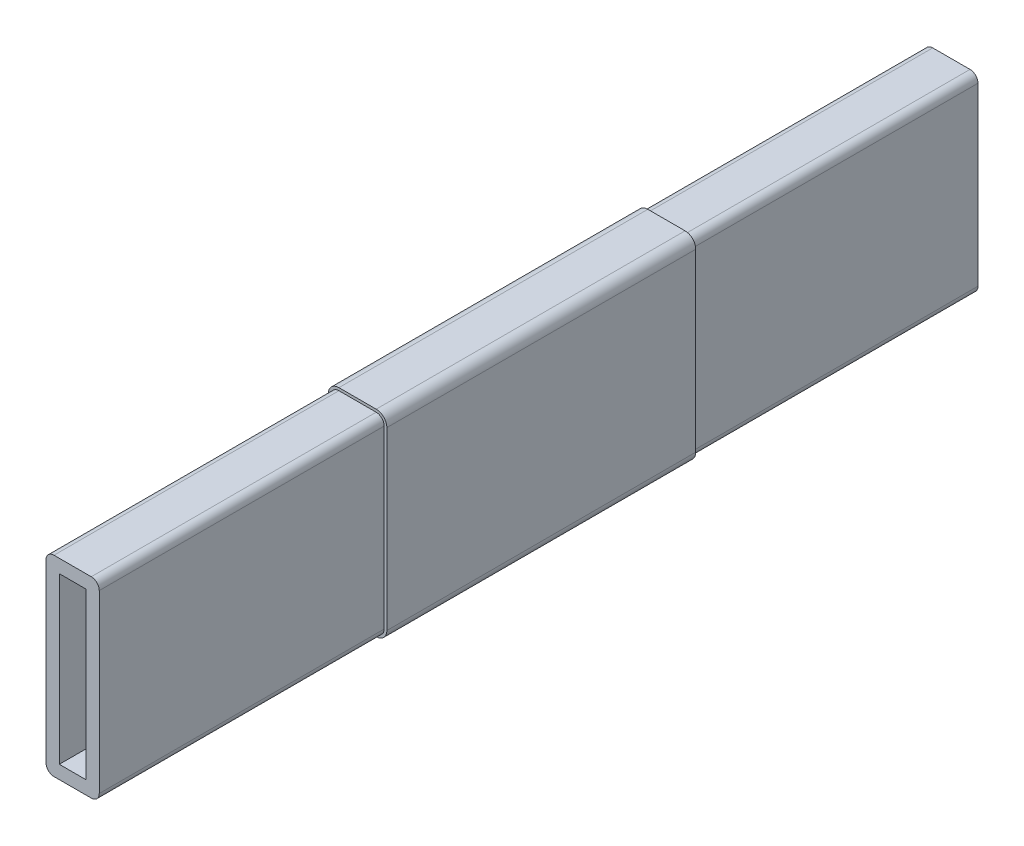
ISO-10303-21;
HEADER;
FILE_DESCRIPTION(('STEP AP214'),'2;1');
FILE_NAME('part.step','',(''),(''),'','','');
FILE_SCHEMA(('AUTOMOTIVE_DESIGN { 1 0 10303 214 1 1 1 1 }'));
ENDSEC;
DATA;
#1=APPLICATION_CONTEXT('core data for automotive mechanical design processes');
#2=APPLICATION_PROTOCOL_DEFINITION('international standard','automotive_design',2000,#1);
#3=PRODUCT_CONTEXT('',#1,'mechanical');
#4=PRODUCT('Part','Part','',(#3));
#5=PRODUCT_RELATED_PRODUCT_CATEGORY('part','',(#4));
#6=PRODUCT_DEFINITION_FORMATION('','',#4);
#7=PRODUCT_DEFINITION_CONTEXT('part definition',#1,'design');
#8=PRODUCT_DEFINITION('design','',#6,#7);
#9=PRODUCT_DEFINITION_SHAPE('','',#8);
#10=(LENGTH_UNIT() NAMED_UNIT(*) SI_UNIT(.MILLI.,.METRE.));
#11=(NAMED_UNIT(*) PLANE_ANGLE_UNIT() SI_UNIT($,.RADIAN.));
#12=(NAMED_UNIT(*) SI_UNIT($,.STERADIAN.) SOLID_ANGLE_UNIT());
#13=UNCERTAINTY_MEASURE_WITH_UNIT(LENGTH_MEASURE(1.E-05),#10,'distance_accuracy_value','');
#14=(GEOMETRIC_REPRESENTATION_CONTEXT(3) GLOBAL_UNCERTAINTY_ASSIGNED_CONTEXT((#13)) GLOBAL_UNIT_ASSIGNED_CONTEXT((#10,
#11,#12)) REPRESENTATION_CONTEXT('',''));
#15=CARTESIAN_POINT('',(0.,0.,0.));
#16=DIRECTION('',(0.,0.,1.));
#17=DIRECTION('',(1.,0.,0.));
#18=AXIS2_PLACEMENT_3D('',#15,#16,#17);
#19=CARTESIAN_POINT('',(0.,0.,0.));
#20=DIRECTION('',(0.,0.,-1.));
#21=DIRECTION('',(-1.,0.,0.));
#22=AXIS2_PLACEMENT_3D('',#19,#20,#21);
#23=PLANE('',#22);
#24=DIRECTION('',(0.,1.,0.));
#25=VECTOR('',#24,1.);
#26=CARTESIAN_POINT('',(5.,-31.,0.));
#27=LINE('',#26,#25);
#28=CARTESIAN_POINT('',(5.,-31.,0.));
#29=VERTEX_POINT('',#28);
#30=CARTESIAN_POINT('',(5.,31.,0.));
#31=VERTEX_POINT('',#30);
#32=EDGE_CURVE('E233',#29,#31,#27,.T.);
#33=ORIENTED_EDGE('',*,*,#32,.T.);
#34=DIRECTION('',(-1.,0.,0.));
#35=VECTOR('',#34,1.);
#36=CARTESIAN_POINT('',(-5.,31.,0.));
#37=LINE('',#36,#35);
#38=CARTESIAN_POINT('',(-5.,31.,0.));
#39=VERTEX_POINT('',#38);
#40=EDGE_CURVE('E245',#31,#39,#37,.T.);
#41=ORIENTED_EDGE('',*,*,#40,.T.);
#42=DIRECTION('',(0.,-1.,0.));
#43=VECTOR('',#42,1.);
#44=CARTESIAN_POINT('',(-5.,-31.,0.));
#45=LINE('',#44,#43);
#46=CARTESIAN_POINT('',(-5.,-31.,0.));
#47=VERTEX_POINT('',#46);
#48=EDGE_CURVE('E251',#39,#47,#45,.T.);
#49=ORIENTED_EDGE('',*,*,#48,.T.);
#50=DIRECTION('',(1.,0.,0.));
#51=VECTOR('',#50,1.);
#52=CARTESIAN_POINT('',(-5.,-31.,0.));
#53=LINE('',#52,#51);
#54=EDGE_CURVE('E241',#47,#29,#53,.T.);
#55=ORIENTED_EDGE('',*,*,#54,.T.);
#56=EDGE_LOOP('',(#33,#41,#49,#55));
#57=FACE_BOUND('',#56,.T.);
#58=DIRECTION('',(1.,0.,0.));
#59=VECTOR('',#58,1.);
#60=CARTESIAN_POINT('',(10.,36.,0.));
#61=LINE('',#60,#59);
#62=CARTESIAN_POINT('',(-7.,36.,0.));
#63=VERTEX_POINT('',#62);
#64=CARTESIAN_POINT('',(7.,36.,0.));
#65=VERTEX_POINT('',#64);
#66=EDGE_CURVE('E624',#63,#65,#61,.T.);
#67=ORIENTED_EDGE('',*,*,#66,.T.);
#68=CARTESIAN_POINT('',(7.,33.,0.));
#69=DIRECTION('',(0.,0.,-1.));
#70=DIRECTION('',(-1.,0.,0.));
#71=AXIS2_PLACEMENT_3D('',#68,#69,#70);
#72=CIRCLE('',#71,3.);
#73=CARTESIAN_POINT('',(10.,33.,0.));
#74=VERTEX_POINT('',#73);
#75=EDGE_CURVE('E345',#65,#74,#72,.T.);
#76=ORIENTED_EDGE('',*,*,#75,.T.);
#77=DIRECTION('',(0.,-1.,0.));
#78=VECTOR('',#77,1.);
#79=CARTESIAN_POINT('',(10.,-36.,0.));
#80=LINE('',#79,#78);
#81=CARTESIAN_POINT('',(10.,-33.,0.));
#82=VERTEX_POINT('',#81);
#83=EDGE_CURVE('E616',#74,#82,#80,.T.);
#84=ORIENTED_EDGE('',*,*,#83,.T.);
#85=CARTESIAN_POINT('',(7.,-33.,0.));
#86=DIRECTION('',(0.,0.,-1.));
#87=DIRECTION('',(-1.,0.,0.));
#88=AXIS2_PLACEMENT_3D('',#85,#86,#87);
#89=CIRCLE('',#88,3.);
#90=CARTESIAN_POINT('',(7.,-36.,0.));
#91=VERTEX_POINT('',#90);
#92=EDGE_CURVE('E342',#82,#91,#89,.T.);
#93=ORIENTED_EDGE('',*,*,#92,.T.);
#94=DIRECTION('',(-1.,0.,0.));
#95=VECTOR('',#94,1.);
#96=CARTESIAN_POINT('',(10.,-36.,0.));
#97=LINE('',#96,#95);
#98=CARTESIAN_POINT('',(-7.,-36.,0.));
#99=VERTEX_POINT('',#98);
#100=EDGE_CURVE('E464',#91,#99,#97,.T.);
#101=ORIENTED_EDGE('',*,*,#100,.T.);
#102=CARTESIAN_POINT('',(-7.,-33.,0.));
#103=DIRECTION('',(0.,0.,-1.));
#104=DIRECTION('',(-1.,0.,0.));
#105=AXIS2_PLACEMENT_3D('',#102,#103,#104);
#106=CIRCLE('',#105,3.);
#107=CARTESIAN_POINT('',(-10.,-33.,0.));
#108=VERTEX_POINT('',#107);
#109=EDGE_CURVE('E339',#99,#108,#106,.T.);
#110=ORIENTED_EDGE('',*,*,#109,.T.);
#111=DIRECTION('',(0.,1.,0.));
#112=VECTOR('',#111,1.);
#113=CARTESIAN_POINT('',(-10.,-36.,0.));
#114=LINE('',#113,#112);
#115=CARTESIAN_POINT('',(-10.,33.,0.));
#116=VERTEX_POINT('',#115);
#117=EDGE_CURVE('E621',#108,#116,#114,.T.);
#118=ORIENTED_EDGE('',*,*,#117,.T.);
#119=CARTESIAN_POINT('',(-7.,33.,0.));
#120=DIRECTION('',(0.,0.,-1.));
#121=DIRECTION('',(-1.,0.,0.));
#122=AXIS2_PLACEMENT_3D('',#119,#120,#121);
#123=CIRCLE('',#122,3.);
#124=EDGE_CURVE('E336',#116,#63,#123,.T.);
#125=ORIENTED_EDGE('',*,*,#124,.T.);
#126=EDGE_LOOP('',(#67,#76,#84,#93,#101,#110,#118,#125));
#127=FACE_BOUND('',#126,.T.);
#128=ADVANCED_FACE('F41',(#57,#127),#23,.T.);
#129=CARTESIAN_POINT('',(0.,0.,330.));
#130=DIRECTION('',(0.,0.,-1.));
#131=DIRECTION('',(-1.,0.,0.));
#132=AXIS2_PLACEMENT_3D('',#129,#130,#131);
#133=PLANE('',#132);
#134=DIRECTION('',(1.,0.,0.));
#135=VECTOR('',#134,1.);
#136=CARTESIAN_POINT('',(0.,31.,330.));
#137=LINE('',#136,#135);
#138=CARTESIAN_POINT('',(-5.,31.,330.));
#139=VERTEX_POINT('',#138);
#140=CARTESIAN_POINT('',(5.,31.,330.));
#141=VERTEX_POINT('',#140);
#142=EDGE_CURVE('E270',#139,#141,#137,.T.);
#143=ORIENTED_EDGE('',*,*,#142,.T.);
#144=DIRECTION('',(0.,-1.,0.));
#145=VECTOR('',#144,1.);
#146=CARTESIAN_POINT('',(5.,0.,330.));
#147=LINE('',#146,#145);
#148=CARTESIAN_POINT('',(5.,-31.,330.));
#149=VERTEX_POINT('',#148);
#150=EDGE_CURVE('E236',#141,#149,#147,.T.);
#151=ORIENTED_EDGE('',*,*,#150,.T.);
#152=DIRECTION('',(-1.,0.,0.));
#153=VECTOR('',#152,1.);
#154=CARTESIAN_POINT('',(0.,-31.,330.));
#155=LINE('',#154,#153);
#156=CARTESIAN_POINT('',(-5.,-31.,330.));
#157=VERTEX_POINT('',#156);
#158=EDGE_CURVE('E283',#149,#157,#155,.T.);
#159=ORIENTED_EDGE('',*,*,#158,.T.);
#160=DIRECTION('',(0.,1.,0.));
#161=VECTOR('',#160,1.);
#162=CARTESIAN_POINT('',(-5.,0.,330.));
#163=LINE('',#162,#161);
#164=EDGE_CURVE('E279',#157,#139,#163,.T.);
#165=ORIENTED_EDGE('',*,*,#164,.T.);
#166=EDGE_LOOP('',(#143,#151,#159,#165));
#167=FACE_BOUND('',#166,.T.);
#168=DIRECTION('',(1.,0.,0.));
#169=VECTOR('',#168,1.);
#170=CARTESIAN_POINT('',(-10.,-36.,330.));
#171=LINE('',#170,#169);
#172=CARTESIAN_POINT('',(-7.,-36.,330.));
#173=VERTEX_POINT('',#172);
#174=CARTESIAN_POINT('',(7.,-36.,330.));
#175=VERTEX_POINT('',#174);
#176=EDGE_CURVE('E479',#173,#175,#171,.T.);
#177=ORIENTED_EDGE('',*,*,#176,.T.);
#178=CARTESIAN_POINT('',(7.,-33.,330.));
#179=DIRECTION('',(0.,0.,-1.));
#180=DIRECTION('',(-1.,0.,0.));
#181=AXIS2_PLACEMENT_3D('',#178,#179,#180);
#182=CIRCLE('',#181,3.);
#183=CARTESIAN_POINT('',(9.99999999999999,-33.,330.));
#184=VERTEX_POINT('',#183);
#185=EDGE_CURVE('E305',#175,#184,#182,.F.);
#186=ORIENTED_EDGE('',*,*,#185,.T.);
#187=DIRECTION('',(0.,1.,0.));
#188=VECTOR('',#187,1.);
#189=CARTESIAN_POINT('',(9.99999999999999,-36.,330.));
#190=LINE('',#189,#188);
#191=CARTESIAN_POINT('',(9.99999999999999,33.,330.));
#192=VERTEX_POINT('',#191);
#193=EDGE_CURVE('E473',#184,#192,#190,.T.);
#194=ORIENTED_EDGE('',*,*,#193,.T.);
#195=CARTESIAN_POINT('',(6.99999999999999,33.,330.));
#196=DIRECTION('',(0.,0.,-1.));
#197=DIRECTION('',(-1.,0.,0.));
#198=AXIS2_PLACEMENT_3D('',#195,#196,#197);
#199=CIRCLE('',#198,3.);
#200=CARTESIAN_POINT('',(7.,36.,330.));
#201=VERTEX_POINT('',#200);
#202=EDGE_CURVE('E299',#192,#201,#199,.F.);
#203=ORIENTED_EDGE('',*,*,#202,.T.);
#204=DIRECTION('',(-1.,0.,0.));
#205=VECTOR('',#204,1.);
#206=CARTESIAN_POINT('',(-10.,36.,330.));
#207=LINE('',#206,#205);
#208=CARTESIAN_POINT('',(-7.,36.,330.));
#209=VERTEX_POINT('',#208);
#210=EDGE_CURVE('E495',#201,#209,#207,.T.);
#211=ORIENTED_EDGE('',*,*,#210,.T.);
#212=CARTESIAN_POINT('',(-7.,33.,330.));
#213=DIRECTION('',(0.,0.,-1.));
#214=DIRECTION('',(-1.,0.,0.));
#215=AXIS2_PLACEMENT_3D('',#212,#213,#214);
#216=CIRCLE('',#215,3.);
#217=CARTESIAN_POINT('',(-10.,33.,330.));
#218=VERTEX_POINT('',#217);
#219=EDGE_CURVE('E296',#209,#218,#216,.F.);
#220=ORIENTED_EDGE('',*,*,#219,.T.);
#221=DIRECTION('',(0.,-1.,0.));
#222=VECTOR('',#221,1.);
#223=CARTESIAN_POINT('',(-10.,-36.,330.));
#224=LINE('',#223,#222);
#225=CARTESIAN_POINT('',(-10.,-33.,330.));
#226=VERTEX_POINT('',#225);
#227=EDGE_CURVE('E499',#218,#226,#224,.T.);
#228=ORIENTED_EDGE('',*,*,#227,.T.);
#229=CARTESIAN_POINT('',(-7.,-33.,330.));
#230=DIRECTION('',(0.,0.,-1.));
#231=DIRECTION('',(-1.,0.,0.));
#232=AXIS2_PLACEMENT_3D('',#229,#230,#231);
#233=CIRCLE('',#232,3.);
#234=EDGE_CURVE('E302',#226,#173,#233,.F.);
#235=ORIENTED_EDGE('',*,*,#234,.T.);
#236=EDGE_LOOP('',(#177,#186,#194,#203,#211,#220,#228,#235));
#237=FACE_BOUND('',#236,.T.);
#238=ADVANCED_FACE('F544',(#167,#237),#133,.F.);
#239=CARTESIAN_POINT('',(11.,-37.,330.));
#240=DIRECTION('',(-1.,0.,0.));
#241=DIRECTION('',(0.,0.,1.));
#242=AXIS2_PLACEMENT_3D('',#239,#240,#241);
#243=PLANE('',#242);
#244=DIRECTION('',(0.,-1.,0.));
#245=VECTOR('',#244,1.);
#246=CARTESIAN_POINT('',(11.,-37.,107.));
#247=LINE('',#246,#245);
#248=CARTESIAN_POINT('',(11.,33.,107.));
#249=VERTEX_POINT('',#248);
#250=CARTESIAN_POINT('',(11.,-33.,107.));
#251=VERTEX_POINT('',#250);
#252=EDGE_CURVE('E458',#249,#251,#247,.T.);
#253=ORIENTED_EDGE('',*,*,#252,.F.);
#254=DIRECTION('',(0.,0.,-1.));
#255=VECTOR('',#254,1.);
#256=CARTESIAN_POINT('',(11.,33.,330.));
#257=LINE('',#256,#255);
#258=CARTESIAN_POINT('',(11.,33.,223.));
#259=VERTEX_POINT('',#258);
#260=EDGE_CURVE('E416',#249,#259,#257,.F.);
#261=ORIENTED_EDGE('',*,*,#260,.T.);
#262=DIRECTION('',(0.,1.,0.));
#263=VECTOR('',#262,1.);
#264=CARTESIAN_POINT('',(11.,-37.,223.));
#265=LINE('',#264,#263);
#266=CARTESIAN_POINT('',(11.,-33.,223.));
#267=VERTEX_POINT('',#266);
#268=EDGE_CURVE('E491',#267,#259,#265,.T.);
#269=ORIENTED_EDGE('',*,*,#268,.F.);
#270=DIRECTION('',(0.,0.,-1.));
#271=VECTOR('',#270,1.);
#272=CARTESIAN_POINT('',(11.,-33.,330.));
#273=LINE('',#272,#271);
#274=EDGE_CURVE('E412',#267,#251,#273,.T.);
#275=ORIENTED_EDGE('',*,*,#274,.T.);
#276=EDGE_LOOP('',(#253,#261,#269,#275));
#277=FACE_BOUND('',#276,.T.);
#278=ADVANCED_FACE('F524',(#277),#243,.F.);
#279=CARTESIAN_POINT('',(-11.,37.,330.));
#280=DIRECTION('',(0.,-1.,0.));
#281=DIRECTION('',(0.,0.,-1.));
#282=AXIS2_PLACEMENT_3D('',#279,#280,#281);
#283=PLANE('',#282);
#284=DIRECTION('',(-1.,0.,0.));
#285=VECTOR('',#284,1.);
#286=CARTESIAN_POINT('',(-11.,37.,223.));
#287=LINE('',#286,#285);
#288=CARTESIAN_POINT('',(6.99999999999999,37.,223.));
#289=VERTEX_POINT('',#288);
#290=CARTESIAN_POINT('',(-7.,37.,223.));
#291=VERTEX_POINT('',#290);
#292=EDGE_CURVE('E509',#289,#291,#287,.T.);
#293=ORIENTED_EDGE('',*,*,#292,.F.);
#294=DIRECTION('',(0.,0.,-1.));
#295=VECTOR('',#294,1.);
#296=CARTESIAN_POINT('',(7.,37.,330.));
#297=LINE('',#296,#295);
#298=CARTESIAN_POINT('',(7.,37.,107.));
#299=VERTEX_POINT('',#298);
#300=EDGE_CURVE('E396',#289,#299,#297,.T.);
#301=ORIENTED_EDGE('',*,*,#300,.T.);
#302=DIRECTION('',(1.,0.,0.));
#303=VECTOR('',#302,1.);
#304=CARTESIAN_POINT('',(11.,37.,107.));
#305=LINE('',#304,#303);
#306=CARTESIAN_POINT('',(-7.,37.,107.));
#307=VERTEX_POINT('',#306);
#308=EDGE_CURVE('E453',#307,#299,#305,.T.);
#309=ORIENTED_EDGE('',*,*,#308,.F.);
#310=DIRECTION('',(0.,0.,-1.));
#311=VECTOR('',#310,1.);
#312=CARTESIAN_POINT('',(-7.,37.,330.));
#313=LINE('',#312,#311);
#314=EDGE_CURVE('E393',#307,#291,#313,.F.);
#315=ORIENTED_EDGE('',*,*,#314,.T.);
#316=EDGE_LOOP('',(#293,#301,#309,#315));
#317=FACE_BOUND('',#316,.T.);
#318=ADVANCED_FACE('F532',(#317),#283,.F.);
#319=CARTESIAN_POINT('',(-11.,-37.,330.));
#320=DIRECTION('',(1.,0.,0.));
#321=DIRECTION('',(0.,0.,-1.));
#322=AXIS2_PLACEMENT_3D('',#319,#320,#321);
#323=PLANE('',#322);
#324=DIRECTION('',(0.,-1.,0.));
#325=VECTOR('',#324,1.);
#326=CARTESIAN_POINT('',(-11.,-37.,223.));
#327=LINE('',#326,#325);
#328=CARTESIAN_POINT('',(-11.,33.,223.));
#329=VERTEX_POINT('',#328);
#330=CARTESIAN_POINT('',(-11.,-33.,223.));
#331=VERTEX_POINT('',#330);
#332=EDGE_CURVE('E259',#329,#331,#327,.T.);
#333=ORIENTED_EDGE('',*,*,#332,.F.);
#334=DIRECTION('',(0.,0.,-1.));
#335=VECTOR('',#334,1.);
#336=CARTESIAN_POINT('',(-11.,33.,330.));
#337=LINE('',#336,#335);
#338=CARTESIAN_POINT('',(-11.,33.,107.));
#339=VERTEX_POINT('',#338);
#340=EDGE_CURVE('E433',#329,#339,#337,.T.);
#341=ORIENTED_EDGE('',*,*,#340,.T.);
#342=DIRECTION('',(0.,1.,0.));
#343=VECTOR('',#342,1.);
#344=CARTESIAN_POINT('',(-11.,-37.,107.));
#345=LINE('',#344,#343);
#346=CARTESIAN_POINT('',(-11.,-33.,107.));
#347=VERTEX_POINT('',#346);
#348=EDGE_CURVE('E443',#347,#339,#345,.T.);
#349=ORIENTED_EDGE('',*,*,#348,.F.);
#350=DIRECTION('',(0.,0.,-1.));
#351=VECTOR('',#350,1.);
#352=CARTESIAN_POINT('',(-11.,-33.,330.));
#353=LINE('',#352,#351);
#354=EDGE_CURVE('E430',#347,#331,#353,.F.);
#355=ORIENTED_EDGE('',*,*,#354,.T.);
#356=EDGE_LOOP('',(#333,#341,#349,#355));
#357=FACE_BOUND('',#356,.T.);
#358=ADVANCED_FACE('F442',(#357),#323,.F.);
#359=CARTESIAN_POINT('',(-11.,-37.,330.));
#360=DIRECTION('',(0.,1.,0.));
#361=DIRECTION('',(0.,0.,1.));
#362=AXIS2_PLACEMENT_3D('',#359,#360,#361);
#363=PLANE('',#362);
#364=DIRECTION('',(1.,0.,0.));
#365=VECTOR('',#364,1.);
#366=CARTESIAN_POINT('',(-11.,-37.,223.));
#367=LINE('',#366,#365);
#368=CARTESIAN_POINT('',(-7.,-37.,223.));
#369=VERTEX_POINT('',#368);
#370=CARTESIAN_POINT('',(6.99999999999999,-37.,223.));
#371=VERTEX_POINT('',#370);
#372=EDGE_CURVE('E256',#369,#371,#367,.T.);
#373=ORIENTED_EDGE('',*,*,#372,.F.);
#374=DIRECTION('',(0.,0.,-1.));
#375=VECTOR('',#374,1.);
#376=CARTESIAN_POINT('',(-7.,-37.,330.));
#377=LINE('',#376,#375);
#378=CARTESIAN_POINT('',(-7.,-37.,107.));
#379=VERTEX_POINT('',#378);
#380=EDGE_CURVE('E11',#369,#379,#377,.T.);
#381=ORIENTED_EDGE('',*,*,#380,.T.);
#382=DIRECTION('',(-1.,0.,0.));
#383=VECTOR('',#382,1.);
#384=CARTESIAN_POINT('',(11.,-37.,107.));
#385=LINE('',#384,#383);
#386=CARTESIAN_POINT('',(7.,-37.,107.));
#387=VERTEX_POINT('',#386);
#388=EDGE_CURVE('E470',#387,#379,#385,.T.);
#389=ORIENTED_EDGE('',*,*,#388,.F.);
#390=DIRECTION('',(0.,0.,-1.));
#391=VECTOR('',#390,1.);
#392=CARTESIAN_POINT('',(7.,-37.,330.));
#393=LINE('',#392,#391);
#394=EDGE_CURVE('E50',#387,#371,#393,.F.);
#395=ORIENTED_EDGE('',*,*,#394,.T.);
#396=EDGE_LOOP('',(#373,#381,#389,#395));
#397=FACE_BOUND('',#396,.T.);
#398=ADVANCED_FACE('F517',(#397),#363,.F.);
#399=CARTESIAN_POINT('',(5.,-31.,0.));
#400=DIRECTION('',(1.,0.,0.));
#401=DIRECTION('',(0.,0.,-1.));
#402=AXIS2_PLACEMENT_3D('',#399,#400,#401);
#403=PLANE('',#402);
#404=DIRECTION('',(0.,0.,1.));
#405=VECTOR('',#404,1.);
#406=CARTESIAN_POINT('',(5.,31.,0.));
#407=LINE('',#406,#405);
#408=EDGE_CURVE('E228',#31,#141,#407,.T.);
#409=ORIENTED_EDGE('',*,*,#408,.F.);
#410=ORIENTED_EDGE('',*,*,#32,.F.);
#411=DIRECTION('',(0.,0.,1.));
#412=VECTOR('',#411,1.);
#413=CARTESIAN_POINT('',(5.,-31.,0.));
#414=LINE('',#413,#412);
#415=EDGE_CURVE('E267',#29,#149,#414,.T.);
#416=ORIENTED_EDGE('',*,*,#415,.T.);
#417=ORIENTED_EDGE('',*,*,#150,.F.);
#418=EDGE_LOOP('',(#409,#410,#416,#417));
#419=FACE_BOUND('',#418,.T.);
#420=ADVANCED_FACE('F230',(#419),#403,.F.);
#421=CARTESIAN_POINT('',(-5.,-31.,0.));
#422=DIRECTION('',(0.,-1.,0.));
#423=DIRECTION('',(0.,0.,-1.));
#424=AXIS2_PLACEMENT_3D('',#421,#422,#423);
#425=PLANE('',#424);
#426=ORIENTED_EDGE('',*,*,#415,.F.);
#427=ORIENTED_EDGE('',*,*,#54,.F.);
#428=DIRECTION('',(0.,0.,1.));
#429=VECTOR('',#428,1.);
#430=CARTESIAN_POINT('',(-5.,-31.,0.));
#431=LINE('',#430,#429);
#432=EDGE_CURVE('E271',#47,#157,#431,.T.);
#433=ORIENTED_EDGE('',*,*,#432,.T.);
#434=ORIENTED_EDGE('',*,*,#158,.F.);
#435=EDGE_LOOP('',(#426,#427,#433,#434));
#436=FACE_BOUND('',#435,.T.);
#437=ADVANCED_FACE('F678',(#436),#425,.F.);
#438=CARTESIAN_POINT('',(-5.,-31.,0.));
#439=DIRECTION('',(-1.,0.,0.));
#440=DIRECTION('',(0.,0.,1.));
#441=AXIS2_PLACEMENT_3D('',#438,#439,#440);
#442=PLANE('',#441);
#443=ORIENTED_EDGE('',*,*,#432,.F.);
#444=ORIENTED_EDGE('',*,*,#48,.F.);
#445=DIRECTION('',(0.,0.,1.));
#446=VECTOR('',#445,1.);
#447=CARTESIAN_POINT('',(-5.,31.,0.));
#448=LINE('',#447,#446);
#449=EDGE_CURVE('E240',#39,#139,#448,.T.);
#450=ORIENTED_EDGE('',*,*,#449,.T.);
#451=ORIENTED_EDGE('',*,*,#164,.F.);
#452=EDGE_LOOP('',(#443,#444,#450,#451));
#453=FACE_BOUND('',#452,.T.);
#454=ADVANCED_FACE('F681',(#453),#442,.F.);
#455=CARTESIAN_POINT('',(-5.,31.,0.));
#456=DIRECTION('',(0.,1.,0.));
#457=DIRECTION('',(0.,0.,1.));
#458=AXIS2_PLACEMENT_3D('',#455,#456,#457);
#459=PLANE('',#458);
#460=ORIENTED_EDGE('',*,*,#449,.F.);
#461=ORIENTED_EDGE('',*,*,#40,.F.);
#462=ORIENTED_EDGE('',*,*,#408,.T.);
#463=ORIENTED_EDGE('',*,*,#142,.F.);
#464=EDGE_LOOP('',(#460,#461,#462,#463));
#465=FACE_BOUND('',#464,.T.);
#466=ADVANCED_FACE('F246',(#465),#459,.F.);
#467=CARTESIAN_POINT('',(0.,0.,223.));
#468=DIRECTION('',(0.,0.,-1.));
#469=DIRECTION('',(-1.,0.,0.));
#470=AXIS2_PLACEMENT_3D('',#467,#468,#469);
#471=PLANE('',#470);
#472=DIRECTION('',(0.,1.,0.));
#473=VECTOR('',#472,1.);
#474=CARTESIAN_POINT('',(9.99999999999999,-36.,223.));
#475=LINE('',#474,#473);
#476=CARTESIAN_POINT('',(9.99999999999999,-33.,223.));
#477=VERTEX_POINT('',#476);
#478=CARTESIAN_POINT('',(9.99999999999999,33.,223.));
#479=VERTEX_POINT('',#478);
#480=EDGE_CURVE('E474',#477,#479,#475,.T.);
#481=ORIENTED_EDGE('',*,*,#480,.F.);
#482=CARTESIAN_POINT('',(7.,-33.,223.));
#483=DIRECTION('',(0.,0.,-1.));
#484=DIRECTION('',(-1.,0.,0.));
#485=AXIS2_PLACEMENT_3D('',#482,#483,#484);
#486=CIRCLE('',#485,3.);
#487=CARTESIAN_POINT('',(7.,-36.,223.));
#488=VERTEX_POINT('',#487);
#489=EDGE_CURVE('E369',#477,#488,#486,.T.);
#490=ORIENTED_EDGE('',*,*,#489,.T.);
#491=DIRECTION('',(1.,0.,0.));
#492=VECTOR('',#491,1.);
#493=CARTESIAN_POINT('',(-10.,-36.,223.));
#494=LINE('',#493,#492);
#495=CARTESIAN_POINT('',(-7.,-36.,223.));
#496=VERTEX_POINT('',#495);
#497=EDGE_CURVE('E487',#496,#488,#494,.T.);
#498=ORIENTED_EDGE('',*,*,#497,.F.);
#499=CARTESIAN_POINT('',(-7.,-33.,223.));
#500=DIRECTION('',(0.,0.,-1.));
#501=DIRECTION('',(-1.,0.,0.));
#502=AXIS2_PLACEMENT_3D('',#499,#500,#501);
#503=CIRCLE('',#502,3.);
#504=CARTESIAN_POINT('',(-10.,-33.,223.));
#505=VERTEX_POINT('',#504);
#506=EDGE_CURVE('E372',#496,#505,#503,.T.);
#507=ORIENTED_EDGE('',*,*,#506,.T.);
#508=DIRECTION('',(0.,-1.,0.));
#509=VECTOR('',#508,1.);
#510=CARTESIAN_POINT('',(-10.,-36.,223.));
#511=LINE('',#510,#509);
#512=CARTESIAN_POINT('',(-10.,33.,223.));
#513=VERTEX_POINT('',#512);
#514=EDGE_CURVE('E483',#513,#505,#511,.T.);
#515=ORIENTED_EDGE('',*,*,#514,.F.);
#516=CARTESIAN_POINT('',(-7.,33.,223.));
#517=DIRECTION('',(0.,0.,-1.));
#518=DIRECTION('',(-1.,0.,0.));
#519=AXIS2_PLACEMENT_3D('',#516,#517,#518);
#520=CIRCLE('',#519,3.);
#521=CARTESIAN_POINT('',(-7.,36.,223.));
#522=VERTEX_POINT('',#521);
#523=EDGE_CURVE('E378',#513,#522,#520,.T.);
#524=ORIENTED_EDGE('',*,*,#523,.T.);
#525=DIRECTION('',(-1.,0.,0.));
#526=VECTOR('',#525,1.);
#527=CARTESIAN_POINT('',(-10.,36.,223.));
#528=LINE('',#527,#526);
#529=CARTESIAN_POINT('',(7.,36.,223.));
#530=VERTEX_POINT('',#529);
#531=EDGE_CURVE('E478',#530,#522,#528,.T.);
#532=ORIENTED_EDGE('',*,*,#531,.F.);
#533=CARTESIAN_POINT('',(6.99999999999999,33.,223.));
#534=DIRECTION('',(0.,0.,-1.));
#535=DIRECTION('',(-1.,0.,0.));
#536=AXIS2_PLACEMENT_3D('',#533,#534,#535);
#537=CIRCLE('',#536,3.);
#538=EDGE_CURVE('E375',#530,#479,#537,.T.);
#539=ORIENTED_EDGE('',*,*,#538,.T.);
#540=EDGE_LOOP('',(#481,#490,#498,#507,#515,#524,#532,#539));
#541=FACE_BOUND('',#540,.T.);
#542=ORIENTED_EDGE('',*,*,#268,.T.);
#543=CARTESIAN_POINT('',(7.,33.,223.));
#544=DIRECTION('',(0.,0.,-1.));
#545=DIRECTION('',(-1.,0.,0.));
#546=AXIS2_PLACEMENT_3D('',#543,#544,#545);
#547=CIRCLE('',#546,4.);
#548=EDGE_CURVE('E427',#259,#289,#547,.F.);
#549=ORIENTED_EDGE('',*,*,#548,.T.);
#550=ORIENTED_EDGE('',*,*,#292,.T.);
#551=CARTESIAN_POINT('',(-7.,33.,223.));
#552=DIRECTION('',(0.,0.,-1.));
#553=DIRECTION('',(-1.,0.,0.));
#554=AXIS2_PLACEMENT_3D('',#551,#552,#553);
#555=CIRCLE('',#554,4.);
#556=EDGE_CURVE('E424',#291,#329,#555,.F.);
#557=ORIENTED_EDGE('',*,*,#556,.T.);
#558=ORIENTED_EDGE('',*,*,#332,.T.);
#559=CARTESIAN_POINT('',(-7.,-33.,223.));
#560=DIRECTION('',(0.,0.,-1.));
#561=DIRECTION('',(-1.,0.,0.));
#562=AXIS2_PLACEMENT_3D('',#559,#560,#561);
#563=CIRCLE('',#562,4.);
#564=EDGE_CURVE('E63',#331,#369,#563,.F.);
#565=ORIENTED_EDGE('',*,*,#564,.T.);
#566=ORIENTED_EDGE('',*,*,#372,.T.);
#567=CARTESIAN_POINT('',(7.,-33.,223.));
#568=DIRECTION('',(0.,0.,-1.));
#569=DIRECTION('',(-1.,0.,0.));
#570=AXIS2_PLACEMENT_3D('',#567,#568,#569);
#571=CIRCLE('',#570,4.);
#572=EDGE_CURVE('E419',#371,#267,#571,.F.);
#573=ORIENTED_EDGE('',*,*,#572,.T.);
#574=EDGE_LOOP('',(#542,#549,#550,#557,#558,#565,#566,#573));
#575=FACE_BOUND('',#574,.T.);
#576=ADVANCED_FACE('F513',(#541,#575),#471,.F.);
#577=CARTESIAN_POINT('',(9.99999999999999,-36.,223.));
#578=DIRECTION('',(1.,0.,0.));
#579=DIRECTION('',(0.,0.,-1.));
#580=AXIS2_PLACEMENT_3D('',#577,#578,#579);
#581=PLANE('',#580);
#582=ORIENTED_EDGE('',*,*,#193,.F.);
#583=DIRECTION('',(0.,0.,1.));
#584=VECTOR('',#583,1.);
#585=CARTESIAN_POINT('',(9.99999999999999,-33.,223.));
#586=LINE('',#585,#584);
#587=EDGE_CURVE('E312',#184,#477,#586,.F.);
#588=ORIENTED_EDGE('',*,*,#587,.T.);
#589=ORIENTED_EDGE('',*,*,#480,.T.);
#590=DIRECTION('',(0.,0.,1.));
#591=VECTOR('',#590,1.);
#592=CARTESIAN_POINT('',(9.99999999999999,33.,223.));
#593=LINE('',#592,#591);
#594=EDGE_CURVE('E308',#479,#192,#593,.T.);
#595=ORIENTED_EDGE('',*,*,#594,.T.);
#596=EDGE_LOOP('',(#582,#588,#589,#595));
#597=FACE_BOUND('',#596,.T.);
#598=ADVANCED_FACE('F664',(#597),#581,.T.);
#599=CARTESIAN_POINT('',(-10.,-36.,223.));
#600=DIRECTION('',(0.,-1.,0.));
#601=DIRECTION('',(0.,0.,-1.));
#602=AXIS2_PLACEMENT_3D('',#599,#600,#601);
#603=PLANE('',#602);
#604=ORIENTED_EDGE('',*,*,#497,.T.);
#605=DIRECTION('',(0.,0.,1.));
#606=VECTOR('',#605,1.);
#607=CARTESIAN_POINT('',(7.,-36.,223.));
#608=LINE('',#607,#606);
#609=EDGE_CURVE('E292',#488,#175,#608,.T.);
#610=ORIENTED_EDGE('',*,*,#609,.T.);
#611=ORIENTED_EDGE('',*,*,#176,.F.);
#612=DIRECTION('',(0.,0.,1.));
#613=VECTOR('',#612,1.);
#614=CARTESIAN_POINT('',(-7.,-36.,223.));
#615=LINE('',#614,#613);
#616=EDGE_CURVE('E289',#173,#496,#615,.F.);
#617=ORIENTED_EDGE('',*,*,#616,.T.);
#618=EDGE_LOOP('',(#604,#610,#611,#617));
#619=FACE_BOUND('',#618,.T.);
#620=ADVANCED_FACE('F660',(#619),#603,.T.);
#621=CARTESIAN_POINT('',(-10.,-36.,223.));
#622=DIRECTION('',(-1.,0.,0.));
#623=DIRECTION('',(0.,0.,1.));
#624=AXIS2_PLACEMENT_3D('',#621,#622,#623);
#625=PLANE('',#624);
#626=ORIENTED_EDGE('',*,*,#514,.T.);
#627=DIRECTION('',(0.,0.,1.));
#628=VECTOR('',#627,1.);
#629=CARTESIAN_POINT('',(-10.,-33.,223.));
#630=LINE('',#629,#628);
#631=EDGE_CURVE('E318',#505,#226,#630,.T.);
#632=ORIENTED_EDGE('',*,*,#631,.T.);
#633=ORIENTED_EDGE('',*,*,#227,.F.);
#634=DIRECTION('',(0.,0.,1.));
#635=VECTOR('',#634,1.);
#636=CARTESIAN_POINT('',(-10.,33.,223.));
#637=LINE('',#636,#635);
#638=EDGE_CURVE('E315',#218,#513,#637,.F.);
#639=ORIENTED_EDGE('',*,*,#638,.T.);
#640=EDGE_LOOP('',(#626,#632,#633,#639));
#641=FACE_BOUND('',#640,.T.);
#642=ADVANCED_FACE('F663',(#641),#625,.T.);
#643=CARTESIAN_POINT('',(-10.,36.,223.));
#644=DIRECTION('',(0.,1.,0.));
#645=DIRECTION('',(0.,0.,1.));
#646=AXIS2_PLACEMENT_3D('',#643,#644,#645);
#647=PLANE('',#646);
#648=ORIENTED_EDGE('',*,*,#210,.F.);
#649=DIRECTION('',(0.,0.,1.));
#650=VECTOR('',#649,1.);
#651=CARTESIAN_POINT('',(7.,36.,223.));
#652=LINE('',#651,#650);
#653=EDGE_CURVE('E326',#201,#530,#652,.F.);
#654=ORIENTED_EDGE('',*,*,#653,.T.);
#655=ORIENTED_EDGE('',*,*,#531,.T.);
#656=DIRECTION('',(0.,0.,1.));
#657=VECTOR('',#656,1.);
#658=CARTESIAN_POINT('',(-7.,36.,223.));
#659=LINE('',#658,#657);
#660=EDGE_CURVE('E322',#522,#209,#659,.T.);
#661=ORIENTED_EDGE('',*,*,#660,.T.);
#662=EDGE_LOOP('',(#648,#654,#655,#661));
#663=FACE_BOUND('',#662,.T.);
#664=ADVANCED_FACE('F659',(#663),#647,.T.);
#665=CARTESIAN_POINT('',(0.,0.,107.));
#666=DIRECTION('',(0.,0.,1.));
#667=DIRECTION('',(1.,0.,0.));
#668=AXIS2_PLACEMENT_3D('',#665,#666,#667);
#669=PLANE('',#668);
#670=DIRECTION('',(0.,1.,0.));
#671=VECTOR('',#670,1.);
#672=CARTESIAN_POINT('',(-10.,-36.,107.));
#673=LINE('',#672,#671);
#674=CARTESIAN_POINT('',(-10.,-33.,107.));
#675=VERTEX_POINT('',#674);
#676=CARTESIAN_POINT('',(-10.,33.,107.));
#677=VERTEX_POINT('',#676);
#678=EDGE_CURVE('E601',#675,#677,#673,.T.);
#679=ORIENTED_EDGE('',*,*,#678,.F.);
#680=CARTESIAN_POINT('',(-7.,-33.,107.));
#681=DIRECTION('',(0.,0.,1.));
#682=DIRECTION('',(1.,0.,0.));
#683=AXIS2_PLACEMENT_3D('',#680,#681,#682);
#684=CIRCLE('',#683,3.);
#685=CARTESIAN_POINT('',(-7.,-36.,107.));
#686=VERTEX_POINT('',#685);
#687=EDGE_CURVE('E387',#675,#686,#684,.T.);
#688=ORIENTED_EDGE('',*,*,#687,.T.);
#689=DIRECTION('',(-1.,0.,0.));
#690=VECTOR('',#689,1.);
#691=CARTESIAN_POINT('',(10.,-36.,107.));
#692=LINE('',#691,#690);
#693=CARTESIAN_POINT('',(7.,-36.,107.));
#694=VERTEX_POINT('',#693);
#695=EDGE_CURVE('E454',#694,#686,#692,.T.);
#696=ORIENTED_EDGE('',*,*,#695,.F.);
#697=CARTESIAN_POINT('',(7.,-33.,107.));
#698=DIRECTION('',(0.,0.,1.));
#699=DIRECTION('',(1.,0.,0.));
#700=AXIS2_PLACEMENT_3D('',#697,#698,#699);
#701=CIRCLE('',#700,3.);
#702=CARTESIAN_POINT('',(10.,-33.,107.));
#703=VERTEX_POINT('',#702);
#704=EDGE_CURVE('E384',#694,#703,#701,.T.);
#705=ORIENTED_EDGE('',*,*,#704,.T.);
#706=DIRECTION('',(0.,-1.,0.));
#707=VECTOR('',#706,1.);
#708=CARTESIAN_POINT('',(10.,-36.,107.));
#709=LINE('',#708,#707);
#710=CARTESIAN_POINT('',(10.,33.,107.));
#711=VERTEX_POINT('',#710);
#712=EDGE_CURVE('E461',#711,#703,#709,.T.);
#713=ORIENTED_EDGE('',*,*,#712,.F.);
#714=CARTESIAN_POINT('',(7.,33.,107.));
#715=DIRECTION('',(0.,0.,1.));
#716=DIRECTION('',(1.,0.,0.));
#717=AXIS2_PLACEMENT_3D('',#714,#715,#716);
#718=CIRCLE('',#717,3.);
#719=CARTESIAN_POINT('',(7.,36.,107.));
#720=VERTEX_POINT('',#719);
#721=EDGE_CURVE('E381',#711,#720,#718,.T.);
#722=ORIENTED_EDGE('',*,*,#721,.T.);
#723=DIRECTION('',(1.,0.,0.));
#724=VECTOR('',#723,1.);
#725=CARTESIAN_POINT('',(10.,36.,107.));
#726=LINE('',#725,#724);
#727=CARTESIAN_POINT('',(-7.,36.,107.));
#728=VERTEX_POINT('',#727);
#729=EDGE_CURVE('E604',#728,#720,#726,.T.);
#730=ORIENTED_EDGE('',*,*,#729,.F.);
#731=CARTESIAN_POINT('',(-7.,33.,107.));
#732=DIRECTION('',(0.,0.,1.));
#733=DIRECTION('',(1.,0.,0.));
#734=AXIS2_PLACEMENT_3D('',#731,#732,#733);
#735=CIRCLE('',#734,3.);
#736=EDGE_CURVE('E390',#728,#677,#735,.T.);
#737=ORIENTED_EDGE('',*,*,#736,.T.);
#738=EDGE_LOOP('',(#679,#688,#696,#705,#713,#722,#730,#737));
#739=FACE_BOUND('',#738,.T.);
#740=ORIENTED_EDGE('',*,*,#308,.T.);
#741=CARTESIAN_POINT('',(7.,33.,107.));
#742=DIRECTION('',(0.,0.,1.));
#743=DIRECTION('',(1.,0.,0.));
#744=AXIS2_PLACEMENT_3D('',#741,#742,#743);
#745=CIRCLE('',#744,4.);
#746=EDGE_CURVE('E409',#299,#249,#745,.F.);
#747=ORIENTED_EDGE('',*,*,#746,.T.);
#748=ORIENTED_EDGE('',*,*,#252,.T.);
#749=CARTESIAN_POINT('',(7.,-33.,107.));
#750=DIRECTION('',(0.,0.,1.));
#751=DIRECTION('',(1.,0.,0.));
#752=AXIS2_PLACEMENT_3D('',#749,#750,#751);
#753=CIRCLE('',#752,4.);
#754=EDGE_CURVE('E400',#251,#387,#753,.F.);
#755=ORIENTED_EDGE('',*,*,#754,.T.);
#756=ORIENTED_EDGE('',*,*,#388,.T.);
#757=CARTESIAN_POINT('',(-7.,-33.,107.));
#758=DIRECTION('',(0.,0.,1.));
#759=DIRECTION('',(1.,0.,0.));
#760=AXIS2_PLACEMENT_3D('',#757,#758,#759);
#761=CIRCLE('',#760,4.);
#762=EDGE_CURVE('E403',#379,#347,#761,.F.);
#763=ORIENTED_EDGE('',*,*,#762,.T.);
#764=ORIENTED_EDGE('',*,*,#348,.T.);
#765=CARTESIAN_POINT('',(-7.,33.,107.));
#766=DIRECTION('',(0.,0.,1.));
#767=DIRECTION('',(1.,0.,0.));
#768=AXIS2_PLACEMENT_3D('',#765,#766,#767);
#769=CIRCLE('',#768,4.);
#770=EDGE_CURVE('E406',#339,#307,#769,.F.);
#771=ORIENTED_EDGE('',*,*,#770,.T.);
#772=EDGE_LOOP('',(#740,#747,#748,#755,#756,#763,#764,#771));
#773=FACE_BOUND('',#772,.T.);
#774=ADVANCED_FACE('F449',(#739,#773),#669,.F.);
#775=CARTESIAN_POINT('',(-10.,-36.,107.));
#776=DIRECTION('',(-1.,0.,0.));
#777=DIRECTION('',(0.,0.,1.));
#778=AXIS2_PLACEMENT_3D('',#775,#776,#777);
#779=PLANE('',#778);
#780=ORIENTED_EDGE('',*,*,#117,.F.);
#781=DIRECTION('',(0.,0.,-1.));
#782=VECTOR('',#781,1.);
#783=CARTESIAN_POINT('',(-10.,-33.,107.));
#784=LINE('',#783,#782);
#785=EDGE_CURVE('E366',#108,#675,#784,.F.);
#786=ORIENTED_EDGE('',*,*,#785,.T.);
#787=ORIENTED_EDGE('',*,*,#678,.T.);
#788=DIRECTION('',(0.,0.,-1.));
#789=VECTOR('',#788,1.);
#790=CARTESIAN_POINT('',(-10.,33.,107.));
#791=LINE('',#790,#789);
#792=EDGE_CURVE('E362',#677,#116,#791,.T.);
#793=ORIENTED_EDGE('',*,*,#792,.T.);
#794=EDGE_LOOP('',(#780,#786,#787,#793));
#795=FACE_BOUND('',#794,.T.);
#796=ADVANCED_FACE('F607',(#795),#779,.T.);
#797=CARTESIAN_POINT('',(10.,-36.,107.));
#798=DIRECTION('',(0.,-1.,0.));
#799=DIRECTION('',(0.,0.,-1.));
#800=AXIS2_PLACEMENT_3D('',#797,#798,#799);
#801=PLANE('',#800);
#802=ORIENTED_EDGE('',*,*,#100,.F.);
#803=DIRECTION('',(0.,0.,-1.));
#804=VECTOR('',#803,1.);
#805=CARTESIAN_POINT('',(7.,-36.,107.));
#806=LINE('',#805,#804);
#807=EDGE_CURVE('E359',#91,#694,#806,.F.);
#808=ORIENTED_EDGE('',*,*,#807,.T.);
#809=ORIENTED_EDGE('',*,*,#695,.T.);
#810=DIRECTION('',(0.,0.,-1.));
#811=VECTOR('',#810,1.);
#812=CARTESIAN_POINT('',(-7.,-36.,107.));
#813=LINE('',#812,#811);
#814=EDGE_CURVE('E355',#686,#99,#813,.T.);
#815=ORIENTED_EDGE('',*,*,#814,.T.);
#816=EDGE_LOOP('',(#802,#808,#809,#815));
#817=FACE_BOUND('',#816,.T.);
#818=ADVANCED_FACE('F644',(#817),#801,.T.);
#819=CARTESIAN_POINT('',(10.,-36.,107.));
#820=DIRECTION('',(1.,0.,0.));
#821=DIRECTION('',(0.,0.,-1.));
#822=AXIS2_PLACEMENT_3D('',#819,#820,#821);
#823=PLANE('',#822);
#824=ORIENTED_EDGE('',*,*,#83,.F.);
#825=DIRECTION('',(0.,0.,-1.));
#826=VECTOR('',#825,1.);
#827=CARTESIAN_POINT('',(10.,33.,107.));
#828=LINE('',#827,#826);
#829=EDGE_CURVE('E352',#74,#711,#828,.F.);
#830=ORIENTED_EDGE('',*,*,#829,.T.);
#831=ORIENTED_EDGE('',*,*,#712,.T.);
#832=DIRECTION('',(0.,0.,-1.));
#833=VECTOR('',#832,1.);
#834=CARTESIAN_POINT('',(10.,-33.,107.));
#835=LINE('',#834,#833);
#836=EDGE_CURVE('E348',#703,#82,#835,.T.);
#837=ORIENTED_EDGE('',*,*,#836,.T.);
#838=EDGE_LOOP('',(#824,#830,#831,#837));
#839=FACE_BOUND('',#838,.T.);
#840=ADVANCED_FACE('F633',(#839),#823,.T.);
#841=CARTESIAN_POINT('',(10.,36.,107.));
#842=DIRECTION('',(0.,1.,0.));
#843=DIRECTION('',(0.,0.,1.));
#844=AXIS2_PLACEMENT_3D('',#841,#842,#843);
#845=PLANE('',#844);
#846=ORIENTED_EDGE('',*,*,#729,.T.);
#847=DIRECTION('',(0.,0.,-1.));
#848=VECTOR('',#847,1.);
#849=CARTESIAN_POINT('',(7.,36.,107.));
#850=LINE('',#849,#848);
#851=EDGE_CURVE('E332',#720,#65,#850,.T.);
#852=ORIENTED_EDGE('',*,*,#851,.T.);
#853=ORIENTED_EDGE('',*,*,#66,.F.);
#854=DIRECTION('',(0.,0.,-1.));
#855=VECTOR('',#854,1.);
#856=CARTESIAN_POINT('',(-7.,36.,107.));
#857=LINE('',#856,#855);
#858=EDGE_CURVE('E329',#63,#728,#857,.F.);
#859=ORIENTED_EDGE('',*,*,#858,.T.);
#860=EDGE_LOOP('',(#846,#852,#853,#859));
#861=FACE_BOUND('',#860,.T.);
#862=ADVANCED_FACE('F565',(#861),#845,.T.);
#863=CARTESIAN_POINT('',(7.,-33.,223.));
#864=DIRECTION('',(0.,0.,1.));
#865=DIRECTION('',(1.,0.,0.));
#866=AXIS2_PLACEMENT_3D('',#863,#864,#865);
#867=CYLINDRICAL_SURFACE('',#866,3.);
#868=ORIENTED_EDGE('',*,*,#489,.F.);
#869=ORIENTED_EDGE('',*,*,#587,.F.);
#870=ORIENTED_EDGE('',*,*,#185,.F.);
#871=ORIENTED_EDGE('',*,*,#609,.F.);
#872=EDGE_LOOP('',(#868,#869,#870,#871));
#873=FACE_BOUND('',#872,.T.);
#874=ADVANCED_FACE('F561',(#873),#867,.T.);
#875=CARTESIAN_POINT('',(-7.,-33.,223.));
#876=DIRECTION('',(0.,0.,1.));
#877=DIRECTION('',(1.,0.,0.));
#878=AXIS2_PLACEMENT_3D('',#875,#876,#877);
#879=CYLINDRICAL_SURFACE('',#878,3.);
#880=ORIENTED_EDGE('',*,*,#506,.F.);
#881=ORIENTED_EDGE('',*,*,#616,.F.);
#882=ORIENTED_EDGE('',*,*,#234,.F.);
#883=ORIENTED_EDGE('',*,*,#631,.F.);
#884=EDGE_LOOP('',(#880,#881,#882,#883));
#885=FACE_BOUND('',#884,.T.);
#886=ADVANCED_FACE('F564',(#885),#879,.T.);
#887=CARTESIAN_POINT('',(6.99999999999999,33.,223.));
#888=DIRECTION('',(0.,0.,1.));
#889=DIRECTION('',(1.,0.,0.));
#890=AXIS2_PLACEMENT_3D('',#887,#888,#889);
#891=CYLINDRICAL_SURFACE('',#890,3.);
#892=ORIENTED_EDGE('',*,*,#538,.F.);
#893=ORIENTED_EDGE('',*,*,#653,.F.);
#894=ORIENTED_EDGE('',*,*,#202,.F.);
#895=ORIENTED_EDGE('',*,*,#594,.F.);
#896=EDGE_LOOP('',(#892,#893,#894,#895));
#897=FACE_BOUND('',#896,.T.);
#898=ADVANCED_FACE('F569',(#897),#891,.T.);
#899=CARTESIAN_POINT('',(-7.,33.,223.));
#900=DIRECTION('',(0.,0.,1.));
#901=DIRECTION('',(1.,0.,0.));
#902=AXIS2_PLACEMENT_3D('',#899,#900,#901);
#903=CYLINDRICAL_SURFACE('',#902,3.);
#904=ORIENTED_EDGE('',*,*,#523,.F.);
#905=ORIENTED_EDGE('',*,*,#638,.F.);
#906=ORIENTED_EDGE('',*,*,#219,.F.);
#907=ORIENTED_EDGE('',*,*,#660,.F.);
#908=EDGE_LOOP('',(#904,#905,#906,#907));
#909=FACE_BOUND('',#908,.T.);
#910=ADVANCED_FACE('F573',(#909),#903,.T.);
#911=CARTESIAN_POINT('',(7.,33.,107.));
#912=DIRECTION('',(0.,0.,-1.));
#913=DIRECTION('',(-1.,0.,0.));
#914=AXIS2_PLACEMENT_3D('',#911,#912,#913);
#915=CYLINDRICAL_SURFACE('',#914,3.);
#916=ORIENTED_EDGE('',*,*,#721,.F.);
#917=ORIENTED_EDGE('',*,*,#829,.F.);
#918=ORIENTED_EDGE('',*,*,#75,.F.);
#919=ORIENTED_EDGE('',*,*,#851,.F.);
#920=EDGE_LOOP('',(#916,#917,#918,#919));
#921=FACE_BOUND('',#920,.T.);
#922=ADVANCED_FACE('F577',(#921),#915,.T.);
#923=CARTESIAN_POINT('',(7.,-33.,107.));
#924=DIRECTION('',(0.,0.,-1.));
#925=DIRECTION('',(-1.,0.,0.));
#926=AXIS2_PLACEMENT_3D('',#923,#924,#925);
#927=CYLINDRICAL_SURFACE('',#926,3.);
#928=ORIENTED_EDGE('',*,*,#704,.F.);
#929=ORIENTED_EDGE('',*,*,#807,.F.);
#930=ORIENTED_EDGE('',*,*,#92,.F.);
#931=ORIENTED_EDGE('',*,*,#836,.F.);
#932=EDGE_LOOP('',(#928,#929,#930,#931));
#933=FACE_BOUND('',#932,.T.);
#934=ADVANCED_FACE('F581',(#933),#927,.T.);
#935=CARTESIAN_POINT('',(-7.,-33.,107.));
#936=DIRECTION('',(0.,0.,-1.));
#937=DIRECTION('',(-1.,0.,0.));
#938=AXIS2_PLACEMENT_3D('',#935,#936,#937);
#939=CYLINDRICAL_SURFACE('',#938,3.);
#940=ORIENTED_EDGE('',*,*,#687,.F.);
#941=ORIENTED_EDGE('',*,*,#785,.F.);
#942=ORIENTED_EDGE('',*,*,#109,.F.);
#943=ORIENTED_EDGE('',*,*,#814,.F.);
#944=EDGE_LOOP('',(#940,#941,#942,#943));
#945=FACE_BOUND('',#944,.T.);
#946=ADVANCED_FACE('F585',(#945),#939,.T.);
#947=CARTESIAN_POINT('',(-7.,33.,107.));
#948=DIRECTION('',(0.,0.,-1.));
#949=DIRECTION('',(-1.,0.,0.));
#950=AXIS2_PLACEMENT_3D('',#947,#948,#949);
#951=CYLINDRICAL_SURFACE('',#950,3.);
#952=ORIENTED_EDGE('',*,*,#736,.F.);
#953=ORIENTED_EDGE('',*,*,#858,.F.);
#954=ORIENTED_EDGE('',*,*,#124,.F.);
#955=ORIENTED_EDGE('',*,*,#792,.F.);
#956=EDGE_LOOP('',(#952,#953,#954,#955));
#957=FACE_BOUND('',#956,.T.);
#958=ADVANCED_FACE('F541',(#957),#951,.T.);
#959=CARTESIAN_POINT('',(7.,33.,330.));
#960=DIRECTION('',(0.,0.,-1.));
#961=DIRECTION('',(-1.,0.,0.));
#962=AXIS2_PLACEMENT_3D('',#959,#960,#961);
#963=CYLINDRICAL_SURFACE('',#962,4.);
#964=ORIENTED_EDGE('',*,*,#548,.F.);
#965=ORIENTED_EDGE('',*,*,#260,.F.);
#966=ORIENTED_EDGE('',*,*,#746,.F.);
#967=ORIENTED_EDGE('',*,*,#300,.F.);
#968=EDGE_LOOP('',(#964,#965,#966,#967));
#969=FACE_BOUND('',#968,.T.);
#970=ADVANCED_FACE('F530',(#969),#963,.T.);
#971=CARTESIAN_POINT('',(-7.,33.,330.));
#972=DIRECTION('',(0.,0.,-1.));
#973=DIRECTION('',(-1.,0.,0.));
#974=AXIS2_PLACEMENT_3D('',#971,#972,#973);
#975=CYLINDRICAL_SURFACE('',#974,4.);
#976=ORIENTED_EDGE('',*,*,#556,.F.);
#977=ORIENTED_EDGE('',*,*,#314,.F.);
#978=ORIENTED_EDGE('',*,*,#770,.F.);
#979=ORIENTED_EDGE('',*,*,#340,.F.);
#980=EDGE_LOOP('',(#976,#977,#978,#979));
#981=FACE_BOUND('',#980,.T.);
#982=ADVANCED_FACE('F534',(#981),#975,.T.);
#983=CARTESIAN_POINT('',(-7.,-33.,330.));
#984=DIRECTION('',(0.,0.,-1.));
#985=DIRECTION('',(-1.,0.,0.));
#986=AXIS2_PLACEMENT_3D('',#983,#984,#985);
#987=CYLINDRICAL_SURFACE('',#986,4.);
#988=ORIENTED_EDGE('',*,*,#564,.F.);
#989=ORIENTED_EDGE('',*,*,#354,.F.);
#990=ORIENTED_EDGE('',*,*,#762,.F.);
#991=ORIENTED_EDGE('',*,*,#380,.F.);
#992=EDGE_LOOP('',(#988,#989,#990,#991));
#993=FACE_BOUND('',#992,.T.);
#994=ADVANCED_FACE('F516',(#993),#987,.T.);
#995=CARTESIAN_POINT('',(7.,-33.,330.));
#996=DIRECTION('',(0.,0.,-1.));
#997=DIRECTION('',(-1.,0.,0.));
#998=AXIS2_PLACEMENT_3D('',#995,#996,#997);
#999=CYLINDRICAL_SURFACE('',#998,4.);
#1000=ORIENTED_EDGE('',*,*,#572,.F.);
#1001=ORIENTED_EDGE('',*,*,#394,.F.);
#1002=ORIENTED_EDGE('',*,*,#754,.F.);
#1003=ORIENTED_EDGE('',*,*,#274,.F.);
#1004=EDGE_LOOP('',(#1000,#1001,#1002,#1003));
#1005=FACE_BOUND('',#1004,.T.);
#1006=ADVANCED_FACE('F43',(#1005),#999,.T.);
#1007=CLOSED_SHELL('',(#128,#238,#278,#318,#358,#398,#420,#437,#454,#466,#576,#598,#620,#642,
#664,#774,#796,#818,#840,#862,#874,#886,#898,#910,#922,#934,#946,#958,#970,#982,#994,#1006));
#1008=MANIFOLD_SOLID_BREP('B2',#1007);
#1009=ADVANCED_BREP_SHAPE_REPRESENTATION('',(#18,#1008),#14);
#1010=SHAPE_DEFINITION_REPRESENTATION(#9,#1009);
ENDSEC;
END-ISO-10303-21;
